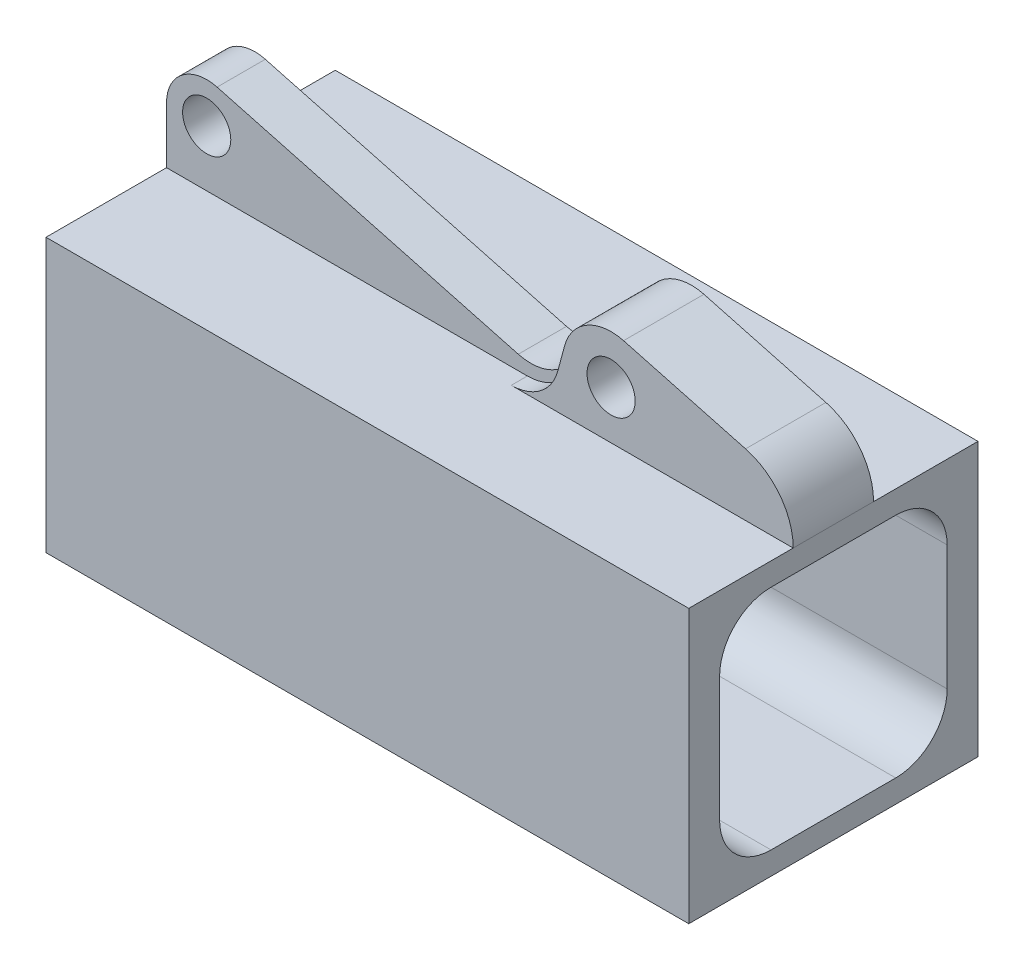
ISO-10303-21;
HEADER;
FILE_DESCRIPTION(('STEP AP214'),'2;1');
FILE_NAME('part.step','',(''),(''),'','','');
FILE_SCHEMA(('AUTOMOTIVE_DESIGN { 1 0 10303 214 1 1 1 1 }'));
ENDSEC;
DATA;
#1=APPLICATION_CONTEXT('core data for automotive mechanical design processes');
#2=APPLICATION_PROTOCOL_DEFINITION('international standard','automotive_design',2000,#1);
#3=PRODUCT_CONTEXT('',#1,'mechanical');
#4=PRODUCT('Part','Part','',(#3));
#5=PRODUCT_RELATED_PRODUCT_CATEGORY('part','',(#4));
#6=PRODUCT_DEFINITION_FORMATION('','',#4);
#7=PRODUCT_DEFINITION_CONTEXT('part definition',#1,'design');
#8=PRODUCT_DEFINITION('design','',#6,#7);
#9=PRODUCT_DEFINITION_SHAPE('','',#8);
#10=(LENGTH_UNIT() NAMED_UNIT(*) SI_UNIT(.MILLI.,.METRE.));
#11=(NAMED_UNIT(*) PLANE_ANGLE_UNIT() SI_UNIT($,.RADIAN.));
#12=(NAMED_UNIT(*) SI_UNIT($,.STERADIAN.) SOLID_ANGLE_UNIT());
#13=UNCERTAINTY_MEASURE_WITH_UNIT(LENGTH_MEASURE(1.E-05),#10,'distance_accuracy_value','');
#14=(GEOMETRIC_REPRESENTATION_CONTEXT(3) GLOBAL_UNCERTAINTY_ASSIGNED_CONTEXT((#13)) GLOBAL_UNIT_ASSIGNED_CONTEXT((#10,
#11,#12)) REPRESENTATION_CONTEXT('',''));
#15=CARTESIAN_POINT('',(0.,0.,0.));
#16=DIRECTION('',(0.,0.,1.));
#17=DIRECTION('',(1.,0.,0.));
#18=AXIS2_PLACEMENT_3D('',#15,#16,#17);
#19=CARTESIAN_POINT('',(31.75,13.49375,14.2875));
#20=DIRECTION('',(0.,-1.,0.));
#21=DIRECTION('',(0.,0.,-1.));
#22=AXIS2_PLACEMENT_3D('',#19,#20,#21);
#23=PLANE('',#22);
#24=DIRECTION('',(-1.,0.,0.));
#25=VECTOR('',#24,1.);
#26=CARTESIAN_POINT('',(0.,13.49375,-2.38125));
#27=LINE('',#26,#25);
#28=CARTESIAN_POINT('',(3.89873140748245,13.49375,-2.38125));
#29=VERTEX_POINT('',#28);
#30=CARTESIAN_POINT('',(-31.75,13.49375,-2.38125));
#31=VERTEX_POINT('',#30);
#32=EDGE_CURVE('E245',#29,#31,#27,.T.);
#33=ORIENTED_EDGE('',*,*,#32,.F.);
#34=DIRECTION('',(0.,0.,-1.));
#35=VECTOR('',#34,1.);
#36=CARTESIAN_POINT('',(3.89873140748245,13.49375,-3.96875));
#37=LINE('',#36,#35);
#38=CARTESIAN_POINT('',(3.89873140748245,13.49375,-3.96875));
#39=VERTEX_POINT('',#38);
#40=EDGE_CURVE('E397',#29,#39,#37,.T.);
#41=ORIENTED_EDGE('',*,*,#40,.T.);
#42=DIRECTION('',(1.,0.,0.));
#43=VECTOR('',#42,1.);
#44=CARTESIAN_POINT('',(31.75,13.49375,-3.96875));
#45=LINE('',#44,#43);
#46=CARTESIAN_POINT('',(31.75,13.49375,-3.96875));
#47=VERTEX_POINT('',#46);
#48=EDGE_CURVE('E257',#39,#47,#45,.T.);
#49=ORIENTED_EDGE('',*,*,#48,.T.);
#50=DIRECTION('',(0.,0.,1.));
#51=VECTOR('',#50,1.);
#52=CARTESIAN_POINT('',(31.75,13.49375,14.2875));
#53=LINE('',#52,#51);
#54=CARTESIAN_POINT('',(31.75,13.49375,-14.2875));
#55=VERTEX_POINT('',#54);
#56=EDGE_CURVE('E323',#55,#47,#53,.T.);
#57=ORIENTED_EDGE('',*,*,#56,.F.);
#58=DIRECTION('',(-1.,0.,0.));
#59=VECTOR('',#58,1.);
#60=CARTESIAN_POINT('',(31.75,13.49375,-14.2875));
#61=LINE('',#60,#59);
#62=CARTESIAN_POINT('',(-31.75,13.49375,-14.2875));
#63=VERTEX_POINT('',#62);
#64=EDGE_CURVE('E347',#55,#63,#61,.T.);
#65=ORIENTED_EDGE('',*,*,#64,.T.);
#66=DIRECTION('',(0.,0.,1.));
#67=VECTOR('',#66,1.);
#68=CARTESIAN_POINT('',(-31.75,13.49375,14.2875));
#69=LINE('',#68,#67);
#70=EDGE_CURVE('E333',#63,#31,#69,.T.);
#71=ORIENTED_EDGE('',*,*,#70,.T.);
#72=EDGE_LOOP('',(#33,#41,#49,#57,#65,#71));
#73=FACE_BOUND('',#72,.T.);
#74=ADVANCED_FACE('F33',(#73),#23,.F.);
#75=CARTESIAN_POINT('',(31.75,0.,0.));
#76=DIRECTION('',(1.,0.,0.));
#77=DIRECTION('',(0.,0.,-1.));
#78=AXIS2_PLACEMENT_3D('',#75,#76,#77);
#79=PLANE('',#78);
#80=DIRECTION('',(0.,1.,0.));
#81=VECTOR('',#80,1.);
#82=CARTESIAN_POINT('',(31.75,13.49375,-14.2875));
#83=LINE('',#82,#81);
#84=CARTESIAN_POINT('',(31.75,-13.49375,-14.2875));
#85=VERTEX_POINT('',#84);
#86=EDGE_CURVE('E318',#85,#55,#83,.T.);
#87=ORIENTED_EDGE('',*,*,#86,.T.);
#88=ORIENTED_EDGE('',*,*,#56,.T.);
#89=DIRECTION('',(0.,0.,-1.));
#90=VECTOR('',#89,1.);
#91=CARTESIAN_POINT('',(31.75,13.49375,3.96875));
#92=LINE('',#91,#90);
#93=CARTESIAN_POINT('',(31.75,13.49375,3.96875));
#94=VERTEX_POINT('',#93);
#95=EDGE_CURVE('E290',#94,#47,#92,.T.);
#96=ORIENTED_EDGE('',*,*,#95,.F.);
#97=CARTESIAN_POINT('',(31.75,13.49375,14.2875));
#98=VERTEX_POINT('',#97);
#99=EDGE_CURVE('E321',#94,#98,#53,.T.);
#100=ORIENTED_EDGE('',*,*,#99,.T.);
#101=DIRECTION('',(0.,-1.,0.));
#102=VECTOR('',#101,1.);
#103=CARTESIAN_POINT('',(31.75,13.49375,14.2875));
#104=LINE('',#103,#102);
#105=CARTESIAN_POINT('',(31.75,-13.49375,14.2875));
#106=VERTEX_POINT('',#105);
#107=EDGE_CURVE('E326',#98,#106,#104,.T.);
#108=ORIENTED_EDGE('',*,*,#107,.T.);
#109=DIRECTION('',(0.,0.,-1.));
#110=VECTOR('',#109,1.);
#111=CARTESIAN_POINT('',(31.75,-13.49375,14.2875));
#112=LINE('',#111,#110);
#113=EDGE_CURVE('E328',#106,#85,#112,.T.);
#114=ORIENTED_EDGE('',*,*,#113,.T.);
#115=EDGE_LOOP('',(#87,#88,#96,#100,#108,#114));
#116=FACE_BOUND('',#115,.T.);
#117=DIRECTION('',(0.,0.,1.));
#118=VECTOR('',#117,1.);
#119=CARTESIAN_POINT('',(31.75,11.2395,11.2395));
#120=LINE('',#119,#118);
#121=CARTESIAN_POINT('',(31.75,11.2395,-6.1595));
#122=VERTEX_POINT('',#121);
#123=CARTESIAN_POINT('',(31.75,11.2395,6.1595));
#124=VERTEX_POINT('',#123);
#125=EDGE_CURVE('E297',#122,#124,#120,.T.);
#126=ORIENTED_EDGE('',*,*,#125,.F.);
#127=CARTESIAN_POINT('',(31.75,6.1595,-6.1595));
#128=DIRECTION('',(1.,0.,0.));
#129=DIRECTION('',(0.,0.,-1.));
#130=AXIS2_PLACEMENT_3D('',#127,#128,#129);
#131=CIRCLE('',#130,5.08);
#132=CARTESIAN_POINT('',(31.75,6.1595,-11.2395));
#133=VERTEX_POINT('',#132);
#134=EDGE_CURVE('E380',#122,#133,#131,.F.);
#135=ORIENTED_EDGE('',*,*,#134,.T.);
#136=DIRECTION('',(0.,1.,0.));
#137=VECTOR('',#136,1.);
#138=CARTESIAN_POINT('',(31.75,11.2395,-11.2395));
#139=LINE('',#138,#137);
#140=CARTESIAN_POINT('',(31.75,-6.1595,-11.2395));
#141=VERTEX_POINT('',#140);
#142=EDGE_CURVE('E294',#141,#133,#139,.T.);
#143=ORIENTED_EDGE('',*,*,#142,.F.);
#144=CARTESIAN_POINT('',(31.75,-6.1595,-6.1595));
#145=DIRECTION('',(1.,0.,0.));
#146=DIRECTION('',(0.,0.,-1.));
#147=AXIS2_PLACEMENT_3D('',#144,#145,#146);
#148=CIRCLE('',#147,5.08);
#149=CARTESIAN_POINT('',(31.75,-11.2395,-6.1595));
#150=VERTEX_POINT('',#149);
#151=EDGE_CURVE('E384',#141,#150,#148,.F.);
#152=ORIENTED_EDGE('',*,*,#151,.T.);
#153=DIRECTION('',(0.,0.,-1.));
#154=VECTOR('',#153,1.);
#155=CARTESIAN_POINT('',(31.75,-11.2395,11.2395));
#156=LINE('',#155,#154);
#157=CARTESIAN_POINT('',(31.75,-11.2395,6.1595));
#158=VERTEX_POINT('',#157);
#159=EDGE_CURVE('E304',#158,#150,#156,.T.);
#160=ORIENTED_EDGE('',*,*,#159,.F.);
#161=CARTESIAN_POINT('',(31.75,-6.1595,6.1595));
#162=DIRECTION('',(1.,0.,0.));
#163=DIRECTION('',(0.,0.,-1.));
#164=AXIS2_PLACEMENT_3D('',#161,#162,#163);
#165=CIRCLE('',#164,5.08);
#166=CARTESIAN_POINT('',(31.75,-6.1595,11.2395));
#167=VERTEX_POINT('',#166);
#168=EDGE_CURVE('E372',#158,#167,#165,.F.);
#169=ORIENTED_EDGE('',*,*,#168,.T.);
#170=DIRECTION('',(0.,-1.,0.));
#171=VECTOR('',#170,1.);
#172=CARTESIAN_POINT('',(31.75,11.2395,11.2395));
#173=LINE('',#172,#171);
#174=CARTESIAN_POINT('',(31.75,6.1595,11.2395));
#175=VERTEX_POINT('',#174);
#176=EDGE_CURVE('E301',#175,#167,#173,.T.);
#177=ORIENTED_EDGE('',*,*,#176,.F.);
#178=CARTESIAN_POINT('',(31.75,6.1595,6.1595));
#179=DIRECTION('',(1.,0.,0.));
#180=DIRECTION('',(0.,0.,-1.));
#181=AXIS2_PLACEMENT_3D('',#178,#179,#180);
#182=CIRCLE('',#181,5.08);
#183=EDGE_CURVE('E376',#175,#124,#182,.F.);
#184=ORIENTED_EDGE('',*,*,#183,.T.);
#185=EDGE_LOOP('',(#126,#135,#143,#152,#160,#169,#177,#184));
#186=FACE_BOUND('',#185,.T.);
#187=ADVANCED_FACE('F453',(#116,#186),#79,.T.);
#188=CARTESIAN_POINT('',(-31.75,0.,0.));
#189=DIRECTION('',(1.,0.,0.));
#190=DIRECTION('',(0.,0.,-1.));
#191=AXIS2_PLACEMENT_3D('',#188,#189,#190);
#192=PLANE('',#191);
#193=DIRECTION('',(0.,1.,0.));
#194=VECTOR('',#193,1.);
#195=CARTESIAN_POINT('',(-31.75,13.49375,-14.2875));
#196=LINE('',#195,#194);
#197=CARTESIAN_POINT('',(-31.75,-13.49375,-14.2875));
#198=VERTEX_POINT('',#197);
#199=EDGE_CURVE('E307',#198,#63,#196,.T.);
#200=ORIENTED_EDGE('',*,*,#199,.F.);
#201=DIRECTION('',(0.,0.,-1.));
#202=VECTOR('',#201,1.);
#203=CARTESIAN_POINT('',(-31.75,-13.49375,14.2875));
#204=LINE('',#203,#202);
#205=CARTESIAN_POINT('',(-31.75,-13.49375,14.2875));
#206=VERTEX_POINT('',#205);
#207=EDGE_CURVE('E322',#206,#198,#204,.T.);
#208=ORIENTED_EDGE('',*,*,#207,.F.);
#209=DIRECTION('',(0.,-1.,0.));
#210=VECTOR('',#209,1.);
#211=CARTESIAN_POINT('',(-31.75,13.49375,14.2875));
#212=LINE('',#211,#210);
#213=CARTESIAN_POINT('',(-31.75,13.49375,14.2875));
#214=VERTEX_POINT('',#213);
#215=EDGE_CURVE('E336',#214,#206,#212,.T.);
#216=ORIENTED_EDGE('',*,*,#215,.F.);
#217=CARTESIAN_POINT('',(-31.75,13.49375,2.38125));
#218=VERTEX_POINT('',#217);
#219=EDGE_CURVE('E229',#218,#214,#69,.T.);
#220=ORIENTED_EDGE('',*,*,#219,.F.);
#221=DIRECTION('',(0.,1.,0.));
#222=VECTOR('',#221,1.);
#223=CARTESIAN_POINT('',(-31.75,0.,2.38125));
#224=LINE('',#223,#222);
#225=CARTESIAN_POINT('',(-31.75,19.05,2.38125));
#226=VERTEX_POINT('',#225);
#227=EDGE_CURVE('E219',#218,#226,#224,.T.);
#228=ORIENTED_EDGE('',*,*,#227,.T.);
#229=DIRECTION('',(0.,0.,-1.));
#230=VECTOR('',#229,1.);
#231=CARTESIAN_POINT('',(-31.75,19.05,2.38125));
#232=LINE('',#231,#230);
#233=CARTESIAN_POINT('',(-31.75,19.05,-2.38125));
#234=VERTEX_POINT('',#233);
#235=EDGE_CURVE('E201',#226,#234,#232,.T.);
#236=ORIENTED_EDGE('',*,*,#235,.T.);
#237=DIRECTION('',(0.,1.,0.));
#238=VECTOR('',#237,1.);
#239=CARTESIAN_POINT('',(-31.75,0.,-2.38125));
#240=LINE('',#239,#238);
#241=EDGE_CURVE('E243',#31,#234,#240,.T.);
#242=ORIENTED_EDGE('',*,*,#241,.F.);
#243=ORIENTED_EDGE('',*,*,#70,.F.);
#244=EDGE_LOOP('',(#200,#208,#216,#220,#228,#236,#242,#243));
#245=FACE_BOUND('',#244,.T.);
#246=DIRECTION('',(0.,0.,-1.));
#247=VECTOR('',#246,1.);
#248=CARTESIAN_POINT('',(-31.75,-11.2395,11.2395));
#249=LINE('',#248,#247);
#250=CARTESIAN_POINT('',(-31.75,-11.2395,6.1595));
#251=VERTEX_POINT('',#250);
#252=CARTESIAN_POINT('',(-31.75,-11.2395,-6.1595));
#253=VERTEX_POINT('',#252);
#254=EDGE_CURVE('E298',#251,#253,#249,.T.);
#255=ORIENTED_EDGE('',*,*,#254,.T.);
#256=CARTESIAN_POINT('',(-31.75,-6.1595,-6.1595));
#257=DIRECTION('',(1.,0.,0.));
#258=DIRECTION('',(0.,0.,-1.));
#259=AXIS2_PLACEMENT_3D('',#256,#257,#258);
#260=CIRCLE('',#259,5.08);
#261=CARTESIAN_POINT('',(-31.75,-6.1595,-11.2395));
#262=VERTEX_POINT('',#261);
#263=EDGE_CURVE('E382',#253,#262,#260,.T.);
#264=ORIENTED_EDGE('',*,*,#263,.T.);
#265=DIRECTION('',(0.,1.,0.));
#266=VECTOR('',#265,1.);
#267=CARTESIAN_POINT('',(-31.75,11.2395,-11.2395));
#268=LINE('',#267,#266);
#269=CARTESIAN_POINT('',(-31.75,6.1595,-11.2395));
#270=VERTEX_POINT('',#269);
#271=EDGE_CURVE('E293',#262,#270,#268,.T.);
#272=ORIENTED_EDGE('',*,*,#271,.T.);
#273=CARTESIAN_POINT('',(-31.75,6.1595,-6.1595));
#274=DIRECTION('',(1.,0.,0.));
#275=DIRECTION('',(0.,0.,-1.));
#276=AXIS2_PLACEMENT_3D('',#273,#274,#275);
#277=CIRCLE('',#276,5.08);
#278=CARTESIAN_POINT('',(-31.75,11.2395,-6.1595));
#279=VERTEX_POINT('',#278);
#280=EDGE_CURVE('E378',#270,#279,#277,.T.);
#281=ORIENTED_EDGE('',*,*,#280,.T.);
#282=DIRECTION('',(0.,0.,1.));
#283=VECTOR('',#282,1.);
#284=CARTESIAN_POINT('',(-31.75,11.2395,11.2395));
#285=LINE('',#284,#283);
#286=CARTESIAN_POINT('',(-31.75,11.2395,6.1595));
#287=VERTEX_POINT('',#286);
#288=EDGE_CURVE('E310',#279,#287,#285,.T.);
#289=ORIENTED_EDGE('',*,*,#288,.T.);
#290=CARTESIAN_POINT('',(-31.75,6.1595,6.1595));
#291=DIRECTION('',(1.,0.,0.));
#292=DIRECTION('',(0.,0.,-1.));
#293=AXIS2_PLACEMENT_3D('',#290,#291,#292);
#294=CIRCLE('',#293,5.08);
#295=CARTESIAN_POINT('',(-31.75,6.1595,11.2395));
#296=VERTEX_POINT('',#295);
#297=EDGE_CURVE('E374',#287,#296,#294,.T.);
#298=ORIENTED_EDGE('',*,*,#297,.T.);
#299=DIRECTION('',(0.,-1.,0.));
#300=VECTOR('',#299,1.);
#301=CARTESIAN_POINT('',(-31.75,11.2395,11.2395));
#302=LINE('',#301,#300);
#303=CARTESIAN_POINT('',(-31.75,-6.1595,11.2395));
#304=VERTEX_POINT('',#303);
#305=EDGE_CURVE('E313',#296,#304,#302,.T.);
#306=ORIENTED_EDGE('',*,*,#305,.T.);
#307=CARTESIAN_POINT('',(-31.75,-6.1595,6.1595));
#308=DIRECTION('',(1.,0.,0.));
#309=DIRECTION('',(0.,0.,-1.));
#310=AXIS2_PLACEMENT_3D('',#307,#308,#309);
#311=CIRCLE('',#310,5.08);
#312=EDGE_CURVE('E370',#304,#251,#311,.T.);
#313=ORIENTED_EDGE('',*,*,#312,.T.);
#314=EDGE_LOOP('',(#255,#264,#272,#281,#289,#298,#306,#313));
#315=FACE_BOUND('',#314,.T.);
#316=ADVANCED_FACE('F226',(#245,#315),#192,.F.);
#317=CARTESIAN_POINT('',(31.75,13.49375,-14.2875));
#318=DIRECTION('',(0.,0.,1.));
#319=DIRECTION('',(0.,-1.,0.));
#320=AXIS2_PLACEMENT_3D('',#317,#318,#319);
#321=PLANE('',#320);
#322=ORIENTED_EDGE('',*,*,#199,.T.);
#323=ORIENTED_EDGE('',*,*,#64,.F.);
#324=ORIENTED_EDGE('',*,*,#86,.F.);
#325=DIRECTION('',(-1.,0.,0.));
#326=VECTOR('',#325,1.);
#327=CARTESIAN_POINT('',(31.75,-13.49375,-14.2875));
#328=LINE('',#327,#326);
#329=EDGE_CURVE('E330',#85,#198,#328,.T.);
#330=ORIENTED_EDGE('',*,*,#329,.T.);
#331=EDGE_LOOP('',(#322,#323,#324,#330));
#332=FACE_BOUND('',#331,.T.);
#333=ADVANCED_FACE('F459',(#332),#321,.F.);
#334=DIRECTION('',(1.,0.,0.));
#335=VECTOR('',#334,1.);
#336=CARTESIAN_POINT('',(31.75,13.49375,3.96875));
#337=LINE('',#336,#335);
#338=CARTESIAN_POINT('',(3.89873140748245,13.49375,3.96875));
#339=VERTEX_POINT('',#338);
#340=EDGE_CURVE('E48',#339,#94,#337,.T.);
#341=ORIENTED_EDGE('',*,*,#340,.F.);
#342=DIRECTION('',(0.,0.,-1.));
#343=VECTOR('',#342,1.);
#344=CARTESIAN_POINT('',(3.89873140748245,13.49375,2.38125));
#345=LINE('',#344,#343);
#346=CARTESIAN_POINT('',(3.89873140748245,13.49375,2.38125));
#347=VERTEX_POINT('',#346);
#348=EDGE_CURVE('E406',#339,#347,#345,.T.);
#349=ORIENTED_EDGE('',*,*,#348,.T.);
#350=DIRECTION('',(-1.,0.,0.));
#351=VECTOR('',#350,1.);
#352=CARTESIAN_POINT('',(0.,13.49375,2.38125));
#353=LINE('',#352,#351);
#354=EDGE_CURVE('E230',#347,#218,#353,.T.);
#355=ORIENTED_EDGE('',*,*,#354,.T.);
#356=ORIENTED_EDGE('',*,*,#219,.T.);
#357=DIRECTION('',(-1.,0.,0.));
#358=VECTOR('',#357,1.);
#359=CARTESIAN_POINT('',(31.75,13.49375,14.2875));
#360=LINE('',#359,#358);
#361=EDGE_CURVE('E344',#98,#214,#360,.T.);
#362=ORIENTED_EDGE('',*,*,#361,.F.);
#363=ORIENTED_EDGE('',*,*,#99,.F.);
#364=EDGE_LOOP('',(#341,#349,#355,#356,#362,#363));
#365=FACE_BOUND('',#364,.T.);
#366=ADVANCED_FACE('F468',(#365),#23,.F.);
#367=CARTESIAN_POINT('',(31.75,13.49375,14.2875));
#368=DIRECTION('',(0.,0.,-1.));
#369=DIRECTION('',(0.,1.,0.));
#370=AXIS2_PLACEMENT_3D('',#367,#368,#369);
#371=PLANE('',#370);
#372=ORIENTED_EDGE('',*,*,#215,.T.);
#373=DIRECTION('',(-1.,0.,0.));
#374=VECTOR('',#373,1.);
#375=CARTESIAN_POINT('',(31.75,-13.49375,14.2875));
#376=LINE('',#375,#374);
#377=EDGE_CURVE('E341',#106,#206,#376,.T.);
#378=ORIENTED_EDGE('',*,*,#377,.F.);
#379=ORIENTED_EDGE('',*,*,#107,.F.);
#380=ORIENTED_EDGE('',*,*,#361,.T.);
#381=EDGE_LOOP('',(#372,#378,#379,#380));
#382=FACE_BOUND('',#381,.T.);
#383=ADVANCED_FACE('F466',(#382),#371,.F.);
#384=CARTESIAN_POINT('',(31.75,-13.49375,14.2875));
#385=DIRECTION('',(0.,1.,0.));
#386=DIRECTION('',(0.,0.,1.));
#387=AXIS2_PLACEMENT_3D('',#384,#385,#386);
#388=PLANE('',#387);
#389=ORIENTED_EDGE('',*,*,#207,.T.);
#390=ORIENTED_EDGE('',*,*,#329,.F.);
#391=ORIENTED_EDGE('',*,*,#113,.F.);
#392=ORIENTED_EDGE('',*,*,#377,.T.);
#393=EDGE_LOOP('',(#389,#390,#391,#392));
#394=FACE_BOUND('',#393,.T.);
#395=ADVANCED_FACE('F462',(#394),#388,.F.);
#396=CARTESIAN_POINT('',(31.75,11.2395,-11.2395));
#397=DIRECTION('',(0.,0.,1.));
#398=DIRECTION('',(1.,0.,0.));
#399=AXIS2_PLACEMENT_3D('',#396,#397,#398);
#400=PLANE('',#399);
#401=ORIENTED_EDGE('',*,*,#142,.T.);
#402=DIRECTION('',(-1.,0.,0.));
#403=VECTOR('',#402,1.);
#404=CARTESIAN_POINT('',(-31.75,6.1595,-11.2395));
#405=LINE('',#404,#403);
#406=EDGE_CURVE('E367',#133,#270,#405,.T.);
#407=ORIENTED_EDGE('',*,*,#406,.T.);
#408=ORIENTED_EDGE('',*,*,#271,.F.);
#409=DIRECTION('',(-1.,0.,0.));
#410=VECTOR('',#409,1.);
#411=CARTESIAN_POINT('',(31.75,-6.1595,-11.2395));
#412=LINE('',#411,#410);
#413=EDGE_CURVE('E365',#262,#141,#412,.F.);
#414=ORIENTED_EDGE('',*,*,#413,.T.);
#415=EDGE_LOOP('',(#401,#407,#408,#414));
#416=FACE_BOUND('',#415,.T.);
#417=ADVANCED_FACE('F487',(#416),#400,.T.);
#418=CARTESIAN_POINT('',(31.75,11.2395,11.2395));
#419=DIRECTION('',(0.,-1.,0.));
#420=DIRECTION('',(0.,0.,-1.));
#421=AXIS2_PLACEMENT_3D('',#418,#419,#420);
#422=PLANE('',#421);
#423=ORIENTED_EDGE('',*,*,#125,.T.);
#424=DIRECTION('',(-1.,0.,0.));
#425=VECTOR('',#424,1.);
#426=CARTESIAN_POINT('',(-31.75,11.2395,6.1595));
#427=LINE('',#426,#425);
#428=EDGE_CURVE('E362',#124,#287,#427,.T.);
#429=ORIENTED_EDGE('',*,*,#428,.T.);
#430=ORIENTED_EDGE('',*,*,#288,.F.);
#431=DIRECTION('',(-1.,0.,0.));
#432=VECTOR('',#431,1.);
#433=CARTESIAN_POINT('',(31.75,11.2395,-6.1595));
#434=LINE('',#433,#432);
#435=EDGE_CURVE('E360',#279,#122,#434,.F.);
#436=ORIENTED_EDGE('',*,*,#435,.T.);
#437=EDGE_LOOP('',(#423,#429,#430,#436));
#438=FACE_BOUND('',#437,.T.);
#439=ADVANCED_FACE('F494',(#438),#422,.T.);
#440=CARTESIAN_POINT('',(31.75,11.2395,11.2395));
#441=DIRECTION('',(0.,0.,-1.));
#442=DIRECTION('',(-1.,0.,0.));
#443=AXIS2_PLACEMENT_3D('',#440,#441,#442);
#444=PLANE('',#443);
#445=ORIENTED_EDGE('',*,*,#176,.T.);
#446=DIRECTION('',(-1.,0.,0.));
#447=VECTOR('',#446,1.);
#448=CARTESIAN_POINT('',(-31.75,-6.1595,11.2395));
#449=LINE('',#448,#447);
#450=EDGE_CURVE('E352',#167,#304,#449,.T.);
#451=ORIENTED_EDGE('',*,*,#450,.T.);
#452=ORIENTED_EDGE('',*,*,#305,.F.);
#453=DIRECTION('',(-1.,0.,0.));
#454=VECTOR('',#453,1.);
#455=CARTESIAN_POINT('',(31.75,6.1595,11.2395));
#456=LINE('',#455,#454);
#457=EDGE_CURVE('E350',#296,#175,#456,.F.);
#458=ORIENTED_EDGE('',*,*,#457,.T.);
#459=EDGE_LOOP('',(#445,#451,#452,#458));
#460=FACE_BOUND('',#459,.T.);
#461=ADVANCED_FACE('F499',(#460),#444,.T.);
#462=CARTESIAN_POINT('',(31.75,-11.2395,11.2395));
#463=DIRECTION('',(0.,1.,0.));
#464=DIRECTION('',(0.,0.,1.));
#465=AXIS2_PLACEMENT_3D('',#462,#463,#464);
#466=PLANE('',#465);
#467=ORIENTED_EDGE('',*,*,#254,.F.);
#468=DIRECTION('',(-1.,0.,0.));
#469=VECTOR('',#468,1.);
#470=CARTESIAN_POINT('',(31.75,-11.2395,6.1595));
#471=LINE('',#470,#469);
#472=EDGE_CURVE('E358',#251,#158,#471,.F.);
#473=ORIENTED_EDGE('',*,*,#472,.T.);
#474=ORIENTED_EDGE('',*,*,#159,.T.);
#475=DIRECTION('',(-1.,0.,0.));
#476=VECTOR('',#475,1.);
#477=CARTESIAN_POINT('',(-31.75,-11.2395,-6.1595));
#478=LINE('',#477,#476);
#479=EDGE_CURVE('E355',#150,#253,#478,.T.);
#480=ORIENTED_EDGE('',*,*,#479,.T.);
#481=EDGE_LOOP('',(#467,#473,#474,#480));
#482=FACE_BOUND('',#481,.T.);
#483=ADVANCED_FACE('F527',(#482),#466,.T.);
#484=CARTESIAN_POINT('',(31.75,-6.1595,6.1595));
#485=DIRECTION('',(1.,0.,0.));
#486=DIRECTION('',(0.,0.,-1.));
#487=AXIS2_PLACEMENT_3D('',#484,#485,#486);
#488=CYLINDRICAL_SURFACE('',#487,5.08);
#489=ORIENTED_EDGE('',*,*,#168,.F.);
#490=ORIENTED_EDGE('',*,*,#472,.F.);
#491=ORIENTED_EDGE('',*,*,#312,.F.);
#492=ORIENTED_EDGE('',*,*,#450,.F.);
#493=EDGE_LOOP('',(#489,#490,#491,#492));
#494=FACE_BOUND('',#493,.T.);
#495=ADVANCED_FACE('F523',(#494),#488,.F.);
#496=CARTESIAN_POINT('',(31.75,6.1595,6.1595));
#497=DIRECTION('',(1.,0.,0.));
#498=DIRECTION('',(0.,0.,-1.));
#499=AXIS2_PLACEMENT_3D('',#496,#497,#498);
#500=CYLINDRICAL_SURFACE('',#499,5.08);
#501=ORIENTED_EDGE('',*,*,#183,.F.);
#502=ORIENTED_EDGE('',*,*,#457,.F.);
#503=ORIENTED_EDGE('',*,*,#297,.F.);
#504=ORIENTED_EDGE('',*,*,#428,.F.);
#505=EDGE_LOOP('',(#501,#502,#503,#504));
#506=FACE_BOUND('',#505,.T.);
#507=ADVANCED_FACE('F515',(#506),#500,.F.);
#508=CARTESIAN_POINT('',(31.75,6.1595,-6.1595));
#509=DIRECTION('',(1.,0.,0.));
#510=DIRECTION('',(0.,0.,-1.));
#511=AXIS2_PLACEMENT_3D('',#508,#509,#510);
#512=CYLINDRICAL_SURFACE('',#511,5.08);
#513=ORIENTED_EDGE('',*,*,#134,.F.);
#514=ORIENTED_EDGE('',*,*,#435,.F.);
#515=ORIENTED_EDGE('',*,*,#280,.F.);
#516=ORIENTED_EDGE('',*,*,#406,.F.);
#517=EDGE_LOOP('',(#513,#514,#515,#516));
#518=FACE_BOUND('',#517,.T.);
#519=ADVANCED_FACE('F508',(#518),#512,.F.);
#520=CARTESIAN_POINT('',(31.75,-6.1595,-6.1595));
#521=DIRECTION('',(1.,0.,0.));
#522=DIRECTION('',(0.,0.,-1.));
#523=AXIS2_PLACEMENT_3D('',#520,#521,#522);
#524=CYLINDRICAL_SURFACE('',#523,5.08);
#525=ORIENTED_EDGE('',*,*,#151,.F.);
#526=ORIENTED_EDGE('',*,*,#413,.F.);
#527=ORIENTED_EDGE('',*,*,#263,.F.);
#528=ORIENTED_EDGE('',*,*,#479,.F.);
#529=EDGE_LOOP('',(#525,#526,#527,#528));
#530=FACE_BOUND('',#529,.T.);
#531=ADVANCED_FACE('F531',(#530),#524,.F.);
#532=CARTESIAN_POINT('',(13.7597370258885,18.25625,3.96875));
#533=DIRECTION('',(0.,0.,-1.));
#534=DIRECTION('',(-1.,0.,0.));
#535=AXIS2_PLACEMENT_3D('',#532,#533,#534);
#536=PLANE('',#535);
#537=ORIENTED_EDGE('',*,*,#340,.T.);
#538=CARTESIAN_POINT('',(25.4,13.49375,3.96875));
#539=DIRECTION('',(0.,0.,1.));
#540=DIRECTION('',(1.,0.,0.));
#541=AXIS2_PLACEMENT_3D('',#538,#539,#540);
#542=CIRCLE('',#541,6.35);
#543=CARTESIAN_POINT('',(27.043500936401,19.6273789969356,3.96875));
#544=VERTEX_POINT('',#543);
#545=EDGE_CURVE('E261',#94,#544,#542,.T.);
#546=ORIENTED_EDGE('',*,*,#545,.T.);
#547=DIRECTION('',(-0.96592582628907,0.258819045102514,0.));
#548=VECTOR('',#547,1.);
#549=CARTESIAN_POINT('',(14.9923627281892,22.8564717477017,3.96875));
#550=LINE('',#549,#548);
#551=CARTESIAN_POINT('',(14.9923627281892,22.8564717477017,3.96875));
#552=VERTEX_POINT('',#551);
#553=EDGE_CURVE('E264',#544,#552,#550,.T.);
#554=ORIENTED_EDGE('',*,*,#553,.T.);
#555=CARTESIAN_POINT('',(13.7597370258885,18.25625,3.96875));
#556=DIRECTION('',(0.,0.,1.));
#557=DIRECTION('',(-1.,0.,0.));
#558=AXIS2_PLACEMENT_3D('',#555,#556,#557);
#559=CIRCLE('',#558,4.7625);
#560=CARTESIAN_POINT('',(9.15951527818678,19.4888757023007,3.96875));
#561=VERTEX_POINT('',#560);
#562=EDGE_CURVE('E266',#552,#561,#559,.T.);
#563=ORIENTED_EDGE('',*,*,#562,.T.);
#564=DIRECTION('',(-0.258819045102514,-0.96592582628907,0.));
#565=VECTOR('',#564,1.);
#566=CARTESIAN_POINT('',(7.55312618773228,13.49375,3.96875));
#567=LINE('',#566,#565);
#568=CARTESIAN_POINT('',(8.49895315518415,17.0236242976993,3.96875));
#569=VERTEX_POINT('',#568);
#570=EDGE_CURVE('E268',#561,#569,#567,.T.);
#571=ORIENTED_EDGE('',*,*,#570,.T.);
#572=CARTESIAN_POINT('',(3.89873140748245,18.25625,3.96875));
#573=DIRECTION('',(0.,0.,-1.));
#574=DIRECTION('',(-1.,0.,0.));
#575=AXIS2_PLACEMENT_3D('',#572,#573,#574);
#576=CIRCLE('',#575,4.7625);
#577=EDGE_CURVE('E11',#569,#339,#576,.T.);
#578=ORIENTED_EDGE('',*,*,#577,.T.);
#579=EDGE_LOOP('',(#537,#546,#554,#563,#571,#578));
#580=FACE_BOUND('',#579,.T.);
#581=CARTESIAN_POINT('',(13.7597370258885,18.25625,3.96875));
#582=DIRECTION('',(0.,0.,1.));
#583=DIRECTION('',(1.,0.,0.));
#584=AXIS2_PLACEMENT_3D('',#581,#582,#583);
#585=CIRCLE('',#584,2.38125000000001);
#586=CARTESIAN_POINT('',(16.1409870258885,18.25625,3.96875));
#587=VERTEX_POINT('',#586);
#588=EDGE_CURVE('E254',#587,#587,#585,.T.);
#589=ORIENTED_EDGE('',*,*,#588,.F.);
#590=EDGE_LOOP('',(#589));
#591=FACE_BOUND('',#590,.T.);
#592=ADVANCED_FACE('F438',(#580,#591),#536,.F.);
#593=CARTESIAN_POINT('',(13.7597370258885,18.25625,-3.96875));
#594=DIRECTION('',(0.,0.,-1.));
#595=DIRECTION('',(-1.,0.,0.));
#596=AXIS2_PLACEMENT_3D('',#593,#594,#595);
#597=PLANE('',#596);
#598=ORIENTED_EDGE('',*,*,#48,.F.);
#599=CARTESIAN_POINT('',(3.89873140748245,18.25625,-3.96875));
#600=DIRECTION('',(0.,0.,-1.));
#601=DIRECTION('',(-1.,0.,0.));
#602=AXIS2_PLACEMENT_3D('',#599,#600,#601);
#603=CIRCLE('',#602,4.7625);
#604=CARTESIAN_POINT('',(8.49895315518415,17.0236242976993,-3.96875));
#605=VERTEX_POINT('',#604);
#606=EDGE_CURVE('E41',#39,#605,#603,.F.);
#607=ORIENTED_EDGE('',*,*,#606,.T.);
#608=DIRECTION('',(-0.258819045102514,-0.96592582628907,0.));
#609=VECTOR('',#608,1.);
#610=CARTESIAN_POINT('',(7.55312618773228,13.49375,-3.96875));
#611=LINE('',#610,#609);
#612=CARTESIAN_POINT('',(9.15951527818678,19.4888757023007,-3.96875));
#613=VERTEX_POINT('',#612);
#614=EDGE_CURVE('E262',#613,#605,#611,.T.);
#615=ORIENTED_EDGE('',*,*,#614,.F.);
#616=CARTESIAN_POINT('',(13.7597370258885,18.25625,-3.96875));
#617=DIRECTION('',(0.,0.,1.));
#618=DIRECTION('',(-1.,0.,0.));
#619=AXIS2_PLACEMENT_3D('',#616,#617,#618);
#620=CIRCLE('',#619,4.7625);
#621=CARTESIAN_POINT('',(14.9923627281892,22.8564717477017,-3.96875));
#622=VERTEX_POINT('',#621);
#623=EDGE_CURVE('E278',#622,#613,#620,.T.);
#624=ORIENTED_EDGE('',*,*,#623,.F.);
#625=DIRECTION('',(-0.96592582628907,0.258819045102514,0.));
#626=VECTOR('',#625,1.);
#627=CARTESIAN_POINT('',(14.9923627281892,22.8564717477017,-3.96875));
#628=LINE('',#627,#626);
#629=CARTESIAN_POINT('',(27.043500936401,19.6273789969356,-3.96875));
#630=VERTEX_POINT('',#629);
#631=EDGE_CURVE('E276',#630,#622,#628,.T.);
#632=ORIENTED_EDGE('',*,*,#631,.F.);
#633=CARTESIAN_POINT('',(25.4,13.49375,-3.96875));
#634=DIRECTION('',(0.,0.,1.));
#635=DIRECTION('',(1.,0.,0.));
#636=AXIS2_PLACEMENT_3D('',#633,#634,#635);
#637=CIRCLE('',#636,6.35);
#638=EDGE_CURVE('E274',#47,#630,#637,.T.);
#639=ORIENTED_EDGE('',*,*,#638,.F.);
#640=EDGE_LOOP('',(#598,#607,#615,#624,#632,#639));
#641=FACE_BOUND('',#640,.T.);
#642=CARTESIAN_POINT('',(13.7597370258885,18.25625,-3.96875));
#643=DIRECTION('',(0.,0.,1.));
#644=DIRECTION('',(1.,0.,0.));
#645=AXIS2_PLACEMENT_3D('',#642,#643,#644);
#646=CIRCLE('',#645,2.38125000000001);
#647=CARTESIAN_POINT('',(16.1409870258885,18.25625,-3.96875));
#648=VERTEX_POINT('',#647);
#649=EDGE_CURVE('E212',#648,#648,#646,.T.);
#650=ORIENTED_EDGE('',*,*,#649,.T.);
#651=EDGE_LOOP('',(#650));
#652=FACE_BOUND('',#651,.T.);
#653=ADVANCED_FACE('F411',(#641,#652),#597,.T.);
#654=CARTESIAN_POINT('',(25.4,13.49375,3.96875));
#655=DIRECTION('',(0.,0.,-1.));
#656=DIRECTION('',(-1.,0.,0.));
#657=AXIS2_PLACEMENT_3D('',#654,#655,#656);
#658=CYLINDRICAL_SURFACE('',#657,6.35);
#659=ORIENTED_EDGE('',*,*,#638,.T.);
#660=DIRECTION('',(0.,0.,-1.));
#661=VECTOR('',#660,1.);
#662=CARTESIAN_POINT('',(27.043500936401,19.6273789969356,3.96875));
#663=LINE('',#662,#661);
#664=EDGE_CURVE('E287',#544,#630,#663,.T.);
#665=ORIENTED_EDGE('',*,*,#664,.F.);
#666=ORIENTED_EDGE('',*,*,#545,.F.);
#667=ORIENTED_EDGE('',*,*,#95,.T.);
#668=EDGE_LOOP('',(#659,#665,#666,#667));
#669=FACE_BOUND('',#668,.T.);
#670=ADVANCED_FACE('F450',(#669),#658,.T.);
#671=CARTESIAN_POINT('',(14.9923627281892,22.8564717477017,3.96875));
#672=DIRECTION('',(-0.258819045102514,-0.96592582628907,0.));
#673=DIRECTION('',(0.96592582628907,-0.258819045102514,0.));
#674=AXIS2_PLACEMENT_3D('',#671,#672,#673);
#675=PLANE('',#674);
#676=ORIENTED_EDGE('',*,*,#631,.T.);
#677=DIRECTION('',(0.,0.,-1.));
#678=VECTOR('',#677,1.);
#679=CARTESIAN_POINT('',(14.9923627281892,22.8564717477017,3.96875));
#680=LINE('',#679,#678);
#681=EDGE_CURVE('E284',#552,#622,#680,.T.);
#682=ORIENTED_EDGE('',*,*,#681,.F.);
#683=ORIENTED_EDGE('',*,*,#553,.F.);
#684=ORIENTED_EDGE('',*,*,#664,.T.);
#685=EDGE_LOOP('',(#676,#682,#683,#684));
#686=FACE_BOUND('',#685,.T.);
#687=ADVANCED_FACE('F447',(#686),#675,.F.);
#688=CARTESIAN_POINT('',(13.7597370258885,18.25625,3.96875));
#689=DIRECTION('',(0.,0.,-1.));
#690=DIRECTION('',(-1.,0.,0.));
#691=AXIS2_PLACEMENT_3D('',#688,#689,#690);
#692=CYLINDRICAL_SURFACE('',#691,4.7625);
#693=ORIENTED_EDGE('',*,*,#623,.T.);
#694=DIRECTION('',(0.,0.,-1.));
#695=VECTOR('',#694,1.);
#696=CARTESIAN_POINT('',(9.15951527818678,19.4888757023007,3.96875));
#697=LINE('',#696,#695);
#698=EDGE_CURVE('E271',#561,#613,#697,.T.);
#699=ORIENTED_EDGE('',*,*,#698,.F.);
#700=ORIENTED_EDGE('',*,*,#562,.F.);
#701=ORIENTED_EDGE('',*,*,#681,.T.);
#702=EDGE_LOOP('',(#693,#699,#700,#701));
#703=FACE_BOUND('',#702,.T.);
#704=ADVANCED_FACE('F444',(#703),#692,.T.);
#705=CARTESIAN_POINT('',(7.55312618773228,13.49375,3.96875));
#706=DIRECTION('',(0.96592582628907,-0.258819045102514,0.));
#707=DIRECTION('',(0.258819045102514,0.96592582628907,0.));
#708=AXIS2_PLACEMENT_3D('',#705,#706,#707);
#709=PLANE('',#708);
#710=ORIENTED_EDGE('',*,*,#614,.T.);
#711=DIRECTION('',(0.,0.,-1.));
#712=VECTOR('',#711,1.);
#713=CARTESIAN_POINT('',(8.49895315518415,17.0236242976993,-2.38125));
#714=LINE('',#713,#712);
#715=CARTESIAN_POINT('',(8.49895315518415,17.0236242976993,-2.38125));
#716=VERTEX_POINT('',#715);
#717=EDGE_CURVE('E402',#605,#716,#714,.F.);
#718=ORIENTED_EDGE('',*,*,#717,.T.);
#719=DIRECTION('',(-0.258819045102514,-0.96592582628907,0.));
#720=VECTOR('',#719,1.);
#721=CARTESIAN_POINT('',(3.67372517214909,-0.984371693091207,-2.38125));
#722=LINE('',#721,#720);
#723=CARTESIAN_POINT('',(8.8350480841436,18.2779476487422,-2.38125));
#724=VERTEX_POINT('',#723);
#725=EDGE_CURVE('E247',#724,#716,#722,.T.);
#726=ORIENTED_EDGE('',*,*,#725,.F.);
#727=DIRECTION('',(0.,0.,-1.));
#728=VECTOR('',#727,1.);
#729=CARTESIAN_POINT('',(8.8350480841436,18.2779476487422,3.96875));
#730=LINE('',#729,#728);
#731=CARTESIAN_POINT('',(8.8350480841436,18.2779476487422,2.38125));
#732=VERTEX_POINT('',#731);
#733=EDGE_CURVE('E389',#724,#732,#730,.F.);
#734=ORIENTED_EDGE('',*,*,#733,.T.);
#735=DIRECTION('',(-0.258819045102514,-0.96592582628907,0.));
#736=VECTOR('',#735,1.);
#737=CARTESIAN_POINT('',(3.67372517214909,-0.984371693091207,2.38125));
#738=LINE('',#737,#736);
#739=CARTESIAN_POINT('',(8.49895315518415,17.0236242976993,2.38125));
#740=VERTEX_POINT('',#739);
#741=EDGE_CURVE('E232',#732,#740,#738,.T.);
#742=ORIENTED_EDGE('',*,*,#741,.T.);
#743=DIRECTION('',(0.,0.,-1.));
#744=VECTOR('',#743,1.);
#745=CARTESIAN_POINT('',(8.49895315518415,17.0236242976993,3.96875));
#746=LINE('',#745,#744);
#747=EDGE_CURVE('E400',#740,#569,#746,.F.);
#748=ORIENTED_EDGE('',*,*,#747,.T.);
#749=ORIENTED_EDGE('',*,*,#570,.F.);
#750=ORIENTED_EDGE('',*,*,#698,.T.);
#751=EDGE_LOOP('',(#710,#718,#726,#734,#742,#748,#749,#750));
#752=FACE_BOUND('',#751,.T.);
#753=ADVANCED_FACE('F418',(#752),#709,.F.);
#754=CARTESIAN_POINT('',(13.7597370258885,18.25625,3.96875));
#755=DIRECTION('',(0.,0.,-1.));
#756=DIRECTION('',(-1.,0.,0.));
#757=AXIS2_PLACEMENT_3D('',#754,#755,#756);
#758=CYLINDRICAL_SURFACE('',#757,2.38125000000001);
#759=ORIENTED_EDGE('',*,*,#588,.T.);
#760=EDGE_LOOP('',(#759));
#761=FACE_BOUND('',#760,.T.);
#762=ORIENTED_EDGE('',*,*,#649,.F.);
#763=EDGE_LOOP('',(#762));
#764=FACE_BOUND('',#763,.T.);
#765=ADVANCED_FACE('F583',(#761,#764),#758,.F.);
#766=CARTESIAN_POINT('',(-27.78125,19.05,2.38125));
#767=DIRECTION('',(0.,0.,-1.));
#768=DIRECTION('',(-1.,0.,0.));
#769=AXIS2_PLACEMENT_3D('',#766,#767,#768);
#770=CYLINDRICAL_SURFACE('',#769,3.96874999999999);
#771=CARTESIAN_POINT('',(-27.78125,19.05,-2.38125));
#772=DIRECTION('',(0.,0.,1.));
#773=DIRECTION('',(1.,0.,0.));
#774=AXIS2_PLACEMENT_3D('',#771,#772,#773);
#775=CIRCLE('',#774,3.96874999999999);
#776=CARTESIAN_POINT('',(-26.7540619147494,22.8835181230847,-2.38125));
#777=VERTEX_POINT('',#776);
#778=EDGE_CURVE('E207',#234,#777,#775,.F.);
#779=ORIENTED_EDGE('',*,*,#778,.F.);
#780=ORIENTED_EDGE('',*,*,#235,.F.);
#781=CARTESIAN_POINT('',(-27.78125,19.05,2.38125));
#782=DIRECTION('',(0.,0.,1.));
#783=DIRECTION('',(1.,0.,0.));
#784=AXIS2_PLACEMENT_3D('',#781,#782,#783);
#785=CIRCLE('',#784,3.96874999999999);
#786=CARTESIAN_POINT('',(-26.7540619147494,22.8835181230847,2.38125));
#787=VERTEX_POINT('',#786);
#788=EDGE_CURVE('E204',#226,#787,#785,.F.);
#789=ORIENTED_EDGE('',*,*,#788,.T.);
#790=DIRECTION('',(0.,0.,-1.));
#791=VECTOR('',#790,1.);
#792=CARTESIAN_POINT('',(-26.7540619147494,22.8835181230847,2.38125));
#793=LINE('',#792,#791);
#794=EDGE_CURVE('E213',#787,#777,#793,.T.);
#795=ORIENTED_EDGE('',*,*,#794,.T.);
#796=EDGE_LOOP('',(#779,#780,#789,#795));
#797=FACE_BOUND('',#796,.T.);
#798=ADVANCED_FACE('F203',(#797),#770,.T.);
#799=CARTESIAN_POINT('',(-27.78125,19.05,2.38125));
#800=DIRECTION('',(0.,0.,-1.));
#801=DIRECTION('',(-1.,0.,0.));
#802=AXIS2_PLACEMENT_3D('',#799,#800,#801);
#803=CYLINDRICAL_SURFACE('',#802,2.38125000000001);
#804=CARTESIAN_POINT('',(-27.78125,19.05,2.38125));
#805=DIRECTION('',(0.,0.,1.));
#806=DIRECTION('',(1.,0.,0.));
#807=AXIS2_PLACEMENT_3D('',#804,#805,#806);
#808=CIRCLE('',#807,2.38125000000001);
#809=CARTESIAN_POINT('',(-25.4,19.05,2.38125));
#810=VERTEX_POINT('',#809);
#811=EDGE_CURVE('E222',#810,#810,#808,.T.);
#812=ORIENTED_EDGE('',*,*,#811,.T.);
#813=EDGE_LOOP('',(#812));
#814=FACE_BOUND('',#813,.T.);
#815=CARTESIAN_POINT('',(-27.78125,19.05,-2.38125));
#816=DIRECTION('',(0.,0.,1.));
#817=DIRECTION('',(1.,0.,0.));
#818=AXIS2_PLACEMENT_3D('',#815,#816,#817);
#819=CIRCLE('',#818,2.38125000000001);
#820=CARTESIAN_POINT('',(-25.4,19.05,-2.38125));
#821=VERTEX_POINT('',#820);
#822=EDGE_CURVE('E239',#821,#821,#819,.T.);
#823=ORIENTED_EDGE('',*,*,#822,.F.);
#824=EDGE_LOOP('',(#823));
#825=FACE_BOUND('',#824,.T.);
#826=ADVANCED_FACE('F627',(#814,#825),#803,.F.);
#827=CARTESIAN_POINT('',(3.9286972096938,14.6620975941318,2.38125));
#828=DIRECTION('',(0.258819045102514,0.96592582628907,0.));
#829=DIRECTION('',(-0.96592582628907,0.258819045102514,0.));
#830=AXIS2_PLACEMENT_3D('',#827,#828,#829);
#831=PLANE('',#830);
#832=DIRECTION('',(0.96592582628907,-0.258819045102514,0.));
#833=VECTOR('',#832,1.);
#834=CARTESIAN_POINT('',(3.9286972096938,14.6620975941318,2.38125));
#835=LINE('',#834,#833);
#836=CARTESIAN_POINT('',(3.00220063414119,14.9103516033413,2.38125));
#837=VERTEX_POINT('',#836);
#838=EDGE_CURVE('E221',#787,#837,#835,.T.);
#839=ORIENTED_EDGE('',*,*,#838,.T.);
#840=DIRECTION('',(0.,0.,-1.));
#841=VECTOR('',#840,1.);
#842=CARTESIAN_POINT('',(3.00220063414119,14.9103516033413,2.38125));
#843=LINE('',#842,#841);
#844=CARTESIAN_POINT('',(3.00220063414119,14.9103516033413,-2.38125));
#845=VERTEX_POINT('',#844);
#846=EDGE_CURVE('E386',#837,#845,#843,.T.);
#847=ORIENTED_EDGE('',*,*,#846,.T.);
#848=DIRECTION('',(0.96592582628907,-0.258819045102514,0.));
#849=VECTOR('',#848,1.);
#850=CARTESIAN_POINT('',(3.9286972096938,14.6620975941318,-2.38125));
#851=LINE('',#850,#849);
#852=EDGE_CURVE('E250',#777,#845,#851,.T.);
#853=ORIENTED_EDGE('',*,*,#852,.F.);
#854=ORIENTED_EDGE('',*,*,#794,.F.);
#855=EDGE_LOOP('',(#839,#847,#853,#854));
#856=FACE_BOUND('',#855,.T.);
#857=ADVANCED_FACE('F430',(#856),#831,.T.);
#858=CARTESIAN_POINT('',(0.,0.,2.38125));
#859=DIRECTION('',(0.,0.,1.));
#860=DIRECTION('',(1.,0.,0.));
#861=AXIS2_PLACEMENT_3D('',#858,#859,#860);
#862=PLANE('',#861);
#863=ORIENTED_EDGE('',*,*,#811,.F.);
#864=EDGE_LOOP('',(#863));
#865=FACE_BOUND('',#864,.T.);
#866=ORIENTED_EDGE('',*,*,#354,.F.);
#867=CARTESIAN_POINT('',(3.89873140748245,18.25625,2.38125));
#868=DIRECTION('',(0.,0.,1.));
#869=DIRECTION('',(1.,0.,0.));
#870=AXIS2_PLACEMENT_3D('',#867,#868,#869);
#871=CIRCLE('',#870,4.7625);
#872=EDGE_CURVE('E55',#347,#740,#871,.T.);
#873=ORIENTED_EDGE('',*,*,#872,.T.);
#874=ORIENTED_EDGE('',*,*,#741,.F.);
#875=CARTESIAN_POINT('',(4.23482633644191,19.510573351043,2.38125));
#876=DIRECTION('',(0.,0.,1.));
#877=DIRECTION('',(1.,0.,0.));
#878=AXIS2_PLACEMENT_3D('',#875,#876,#877);
#879=CIRCLE('',#878,4.7625);
#880=EDGE_CURVE('E395',#732,#837,#879,.F.);
#881=ORIENTED_EDGE('',*,*,#880,.T.);
#882=ORIENTED_EDGE('',*,*,#838,.F.);
#883=ORIENTED_EDGE('',*,*,#788,.F.);
#884=ORIENTED_EDGE('',*,*,#227,.F.);
#885=EDGE_LOOP('',(#866,#873,#874,#881,#882,#883,#884));
#886=FACE_BOUND('',#885,.T.);
#887=ADVANCED_FACE('F218',(#865,#886),#862,.T.);
#888=CARTESIAN_POINT('',(0.,0.,-2.38125));
#889=DIRECTION('',(0.,0.,1.));
#890=DIRECTION('',(1.,0.,0.));
#891=AXIS2_PLACEMENT_3D('',#888,#889,#890);
#892=PLANE('',#891);
#893=ORIENTED_EDGE('',*,*,#822,.T.);
#894=EDGE_LOOP('',(#893));
#895=FACE_BOUND('',#894,.T.);
#896=ORIENTED_EDGE('',*,*,#725,.T.);
#897=CARTESIAN_POINT('',(3.89873140748245,18.25625,-2.38125));
#898=DIRECTION('',(0.,0.,1.));
#899=DIRECTION('',(1.,0.,0.));
#900=AXIS2_PLACEMENT_3D('',#897,#898,#899);
#901=CIRCLE('',#900,4.7625);
#902=EDGE_CURVE('E404',#716,#29,#901,.F.);
#903=ORIENTED_EDGE('',*,*,#902,.T.);
#904=ORIENTED_EDGE('',*,*,#32,.T.);
#905=ORIENTED_EDGE('',*,*,#241,.T.);
#906=ORIENTED_EDGE('',*,*,#778,.T.);
#907=ORIENTED_EDGE('',*,*,#852,.T.);
#908=CARTESIAN_POINT('',(4.23482633644191,19.510573351043,-2.38125));
#909=DIRECTION('',(0.,0.,1.));
#910=DIRECTION('',(1.,0.,0.));
#911=AXIS2_PLACEMENT_3D('',#908,#909,#910);
#912=CIRCLE('',#911,4.7625);
#913=EDGE_CURVE('E392',#845,#724,#912,.T.);
#914=ORIENTED_EDGE('',*,*,#913,.T.);
#915=EDGE_LOOP('',(#896,#903,#904,#905,#906,#907,#914));
#916=FACE_BOUND('',#915,.T.);
#917=ADVANCED_FACE('F425',(#895,#916),#892,.F.);
#918=CARTESIAN_POINT('',(4.23482633644191,19.510573351043,2.38125));
#919=DIRECTION('',(0.,0.,-1.));
#920=DIRECTION('',(-1.,0.,0.));
#921=AXIS2_PLACEMENT_3D('',#918,#919,#920);
#922=CYLINDRICAL_SURFACE('',#921,4.7625);
#923=ORIENTED_EDGE('',*,*,#880,.F.);
#924=ORIENTED_EDGE('',*,*,#733,.F.);
#925=ORIENTED_EDGE('',*,*,#913,.F.);
#926=ORIENTED_EDGE('',*,*,#846,.F.);
#927=EDGE_LOOP('',(#923,#924,#925,#926));
#928=FACE_BOUND('',#927,.T.);
#929=ADVANCED_FACE('F434',(#928),#922,.F.);
#930=CARTESIAN_POINT('',(3.89873140748245,18.25625,14.2875));
#931=DIRECTION('',(0.,0.,1.));
#932=DIRECTION('',(1.,0.,0.));
#933=AXIS2_PLACEMENT_3D('',#930,#931,#932);
#934=CYLINDRICAL_SURFACE('',#933,4.7625);
#935=ORIENTED_EDGE('',*,*,#902,.F.);
#936=ORIENTED_EDGE('',*,*,#717,.F.);
#937=ORIENTED_EDGE('',*,*,#606,.F.);
#938=ORIENTED_EDGE('',*,*,#40,.F.);
#939=EDGE_LOOP('',(#935,#936,#937,#938));
#940=FACE_BOUND('',#939,.T.);
#941=ADVANCED_FACE('F422',(#940),#934,.F.);
#942=CARTESIAN_POINT('',(3.89873140748245,18.25625,14.2875));
#943=DIRECTION('',(0.,0.,1.));
#944=DIRECTION('',(1.,0.,0.));
#945=AXIS2_PLACEMENT_3D('',#942,#943,#944);
#946=CYLINDRICAL_SURFACE('',#945,4.7625);
#947=ORIENTED_EDGE('',*,*,#577,.F.);
#948=ORIENTED_EDGE('',*,*,#747,.F.);
#949=ORIENTED_EDGE('',*,*,#872,.F.);
#950=ORIENTED_EDGE('',*,*,#348,.F.);
#951=EDGE_LOOP('',(#947,#948,#949,#950));
#952=FACE_BOUND('',#951,.T.);
#953=ADVANCED_FACE('F35',(#952),#946,.F.);
#954=CLOSED_SHELL('',(#74,#187,#316,#333,#366,#383,#395,#417,#439,#461,#483,#495,#507,#519,#531,
#592,#653,#670,#687,#704,#753,#765,#798,#826,#857,#887,#917,#929,#941,#953));
#955=MANIFOLD_SOLID_BREP('B2',#954);
#956=ADVANCED_BREP_SHAPE_REPRESENTATION('',(#18,#955),#14);
#957=SHAPE_DEFINITION_REPRESENTATION(#9,#956);
ENDSEC;
END-ISO-10303-21;
